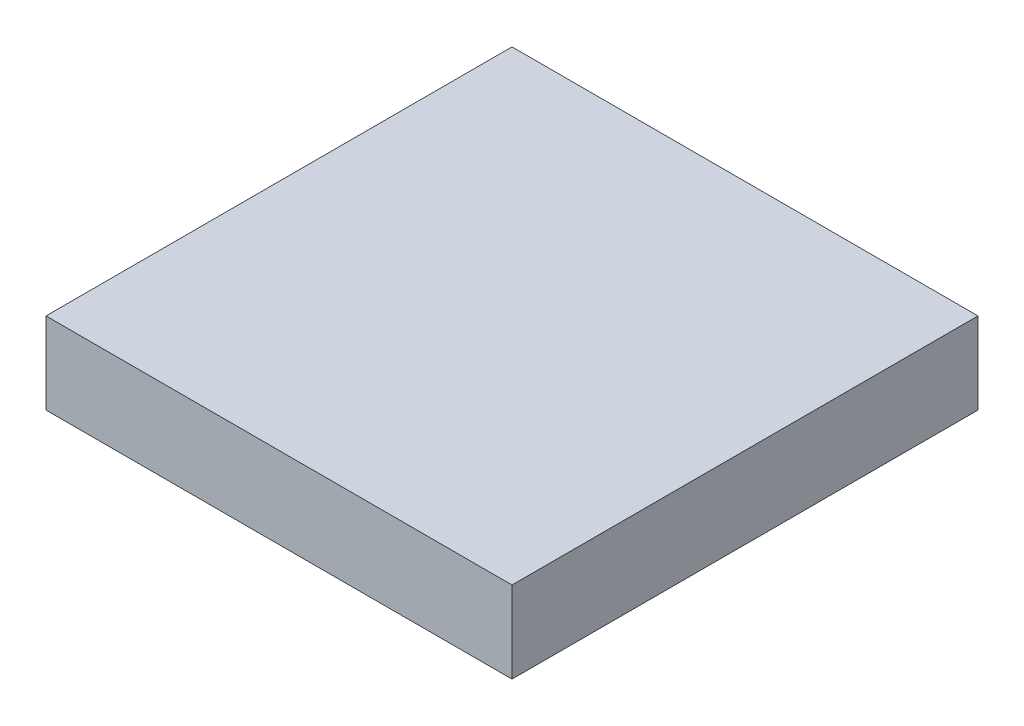
ISO-10303-21;
HEADER;
FILE_DESCRIPTION(('STEP AP214'),'2;1');
FILE_NAME('part.step','',(''),(''),'','','');
FILE_SCHEMA(('AUTOMOTIVE_DESIGN { 1 0 10303 214 1 1 1 1 }'));
ENDSEC;
DATA;
#1=APPLICATION_CONTEXT('core data for automotive mechanical design processes');
#2=APPLICATION_PROTOCOL_DEFINITION('international standard','automotive_design',2000,#1);
#3=PRODUCT_CONTEXT('',#1,'mechanical');
#4=PRODUCT('Part','Part','',(#3));
#5=PRODUCT_RELATED_PRODUCT_CATEGORY('part','',(#4));
#6=PRODUCT_DEFINITION_FORMATION('','',#4);
#7=PRODUCT_DEFINITION_CONTEXT('part definition',#1,'design');
#8=PRODUCT_DEFINITION('design','',#6,#7);
#9=PRODUCT_DEFINITION_SHAPE('','',#8);
#10=(LENGTH_UNIT() NAMED_UNIT(*) SI_UNIT(.MILLI.,.METRE.));
#11=(NAMED_UNIT(*) PLANE_ANGLE_UNIT() SI_UNIT($,.RADIAN.));
#12=(NAMED_UNIT(*) SI_UNIT($,.STERADIAN.) SOLID_ANGLE_UNIT());
#13=UNCERTAINTY_MEASURE_WITH_UNIT(LENGTH_MEASURE(1.E-05),#10,'distance_accuracy_value','');
#14=(GEOMETRIC_REPRESENTATION_CONTEXT(3) GLOBAL_UNCERTAINTY_ASSIGNED_CONTEXT((#13)) GLOBAL_UNIT_ASSIGNED_CONTEXT((#10,
#11,#12)) REPRESENTATION_CONTEXT('',''));
#15=CARTESIAN_POINT('',(0.,0.,0.));
#16=DIRECTION('',(0.,0.,1.));
#17=DIRECTION('',(1.,0.,0.));
#18=AXIS2_PLACEMENT_3D('',#15,#16,#17);
#19=CARTESIAN_POINT('',(28.575,10.,-28.575));
#20=DIRECTION('',(-1.,0.,0.));
#21=DIRECTION('',(0.,0.,1.));
#22=AXIS2_PLACEMENT_3D('',#19,#20,#21);
#23=PLANE('',#22);
#24=DIRECTION('',(0.,0.,-1.));
#25=VECTOR('',#24,1.);
#26=CARTESIAN_POINT('',(28.575,0.,-28.575));
#27=LINE('',#26,#25);
#28=CARTESIAN_POINT('',(28.575,0.,28.575));
#29=VERTEX_POINT('',#28);
#30=CARTESIAN_POINT('',(28.575,0.,-28.575));
#31=VERTEX_POINT('',#30);
#32=EDGE_CURVE('E112',#29,#31,#27,.T.);
#33=ORIENTED_EDGE('',*,*,#32,.T.);
#34=DIRECTION('',(0.,-1.,0.));
#35=VECTOR('',#34,1.);
#36=CARTESIAN_POINT('',(28.575,10.,-28.575));
#37=LINE('',#36,#35);
#38=CARTESIAN_POINT('',(28.575,10.,-28.575));
#39=VERTEX_POINT('',#38);
#40=EDGE_CURVE('E12',#39,#31,#37,.T.);
#41=ORIENTED_EDGE('',*,*,#40,.F.);
#42=DIRECTION('',(0.,0.,-1.));
#43=VECTOR('',#42,1.);
#44=CARTESIAN_POINT('',(28.575,10.,-28.575));
#45=LINE('',#44,#43);
#46=CARTESIAN_POINT('',(28.575,10.,28.575));
#47=VERTEX_POINT('',#46);
#48=EDGE_CURVE('E100',#47,#39,#45,.T.);
#49=ORIENTED_EDGE('',*,*,#48,.F.);
#50=DIRECTION('',(0.,-1.,0.));
#51=VECTOR('',#50,1.);
#52=CARTESIAN_POINT('',(28.575,10.,28.575));
#53=LINE('',#52,#51);
#54=EDGE_CURVE('E108',#47,#29,#53,.T.);
#55=ORIENTED_EDGE('',*,*,#54,.T.);
#56=EDGE_LOOP('',(#33,#41,#49,#55));
#57=FACE_BOUND('',#56,.T.);
#58=ADVANCED_FACE('F49',(#57),#23,.F.);
#59=CARTESIAN_POINT('',(-28.575,10.,-28.575));
#60=DIRECTION('',(0.,0.,1.));
#61=DIRECTION('',(1.,0.,0.));
#62=AXIS2_PLACEMENT_3D('',#59,#60,#61);
#63=PLANE('',#62);
#64=DIRECTION('',(-1.,0.,0.));
#65=VECTOR('',#64,1.);
#66=CARTESIAN_POINT('',(-28.575,0.,-28.575));
#67=LINE('',#66,#65);
#68=CARTESIAN_POINT('',(-28.575,0.,-28.575));
#69=VERTEX_POINT('',#68);
#70=EDGE_CURVE('E104',#31,#69,#67,.T.);
#71=ORIENTED_EDGE('',*,*,#70,.T.);
#72=DIRECTION('',(0.,-1.,0.));
#73=VECTOR('',#72,1.);
#74=CARTESIAN_POINT('',(-28.575,10.,-28.575));
#75=LINE('',#74,#73);
#76=CARTESIAN_POINT('',(-28.575,10.,-28.575));
#77=VERTEX_POINT('',#76);
#78=EDGE_CURVE('E57',#77,#69,#75,.T.);
#79=ORIENTED_EDGE('',*,*,#78,.F.);
#80=DIRECTION('',(-1.,0.,0.));
#81=VECTOR('',#80,1.);
#82=CARTESIAN_POINT('',(-28.575,10.,-28.575));
#83=LINE('',#82,#81);
#84=EDGE_CURVE('E95',#39,#77,#83,.T.);
#85=ORIENTED_EDGE('',*,*,#84,.F.);
#86=ORIENTED_EDGE('',*,*,#40,.T.);
#87=EDGE_LOOP('',(#71,#79,#85,#86));
#88=FACE_BOUND('',#87,.T.);
#89=ADVANCED_FACE('F103',(#88),#63,.F.);
#90=CARTESIAN_POINT('',(-28.575,10.,-28.575));
#91=DIRECTION('',(1.,0.,0.));
#92=DIRECTION('',(0.,0.,-1.));
#93=AXIS2_PLACEMENT_3D('',#90,#91,#92);
#94=PLANE('',#93);
#95=DIRECTION('',(0.,0.,1.));
#96=VECTOR('',#95,1.);
#97=CARTESIAN_POINT('',(-28.575,0.,-28.575));
#98=LINE('',#97,#96);
#99=CARTESIAN_POINT('',(-28.575,0.,28.575));
#100=VERTEX_POINT('',#99);
#101=EDGE_CURVE('E82',#69,#100,#98,.T.);
#102=ORIENTED_EDGE('',*,*,#101,.T.);
#103=DIRECTION('',(0.,-1.,0.));
#104=VECTOR('',#103,1.);
#105=CARTESIAN_POINT('',(-28.575,10.,28.575));
#106=LINE('',#105,#104);
#107=CARTESIAN_POINT('',(-28.575,10.,28.575));
#108=VERTEX_POINT('',#107);
#109=EDGE_CURVE('E105',#108,#100,#106,.T.);
#110=ORIENTED_EDGE('',*,*,#109,.F.);
#111=DIRECTION('',(0.,0.,1.));
#112=VECTOR('',#111,1.);
#113=CARTESIAN_POINT('',(-28.575,10.,-28.575));
#114=LINE('',#113,#112);
#115=EDGE_CURVE('E98',#77,#108,#114,.T.);
#116=ORIENTED_EDGE('',*,*,#115,.F.);
#117=ORIENTED_EDGE('',*,*,#78,.T.);
#118=EDGE_LOOP('',(#102,#110,#116,#117));
#119=FACE_BOUND('',#118,.T.);
#120=ADVANCED_FACE('F106',(#119),#94,.F.);
#121=CARTESIAN_POINT('',(-28.575,10.,28.575));
#122=DIRECTION('',(0.,0.,-1.));
#123=DIRECTION('',(-1.,0.,0.));
#124=AXIS2_PLACEMENT_3D('',#121,#122,#123);
#125=PLANE('',#124);
#126=DIRECTION('',(1.,0.,0.));
#127=VECTOR('',#126,1.);
#128=CARTESIAN_POINT('',(-28.575,0.,28.575));
#129=LINE('',#128,#127);
#130=EDGE_CURVE('E88',#100,#29,#129,.T.);
#131=ORIENTED_EDGE('',*,*,#130,.T.);
#132=ORIENTED_EDGE('',*,*,#54,.F.);
#133=DIRECTION('',(1.,0.,0.));
#134=VECTOR('',#133,1.);
#135=CARTESIAN_POINT('',(-28.575,10.,28.575));
#136=LINE('',#135,#134);
#137=EDGE_CURVE('E65',#108,#47,#136,.T.);
#138=ORIENTED_EDGE('',*,*,#137,.F.);
#139=ORIENTED_EDGE('',*,*,#109,.T.);
#140=EDGE_LOOP('',(#131,#132,#138,#139));
#141=FACE_BOUND('',#140,.T.);
#142=ADVANCED_FACE('F119',(#141),#125,.F.);
#143=CARTESIAN_POINT('',(0.,10.,0.));
#144=DIRECTION('',(0.,1.,0.));
#145=DIRECTION('',(0.,0.,1.));
#146=AXIS2_PLACEMENT_3D('',#143,#144,#145);
#147=PLANE('',#146);
#148=ORIENTED_EDGE('',*,*,#48,.T.);
#149=ORIENTED_EDGE('',*,*,#84,.T.);
#150=ORIENTED_EDGE('',*,*,#115,.T.);
#151=ORIENTED_EDGE('',*,*,#137,.T.);
#152=EDGE_LOOP('',(#148,#149,#150,#151));
#153=FACE_BOUND('',#152,.T.);
#154=ADVANCED_FACE('F96',(#153),#147,.T.);
#155=CARTESIAN_POINT('',(0.,0.,0.));
#156=DIRECTION('',(0.,1.,0.));
#157=DIRECTION('',(0.,0.,1.));
#158=AXIS2_PLACEMENT_3D('',#155,#156,#157);
#159=PLANE('',#158);
#160=ORIENTED_EDGE('',*,*,#32,.F.);
#161=ORIENTED_EDGE('',*,*,#130,.F.);
#162=ORIENTED_EDGE('',*,*,#101,.F.);
#163=ORIENTED_EDGE('',*,*,#70,.F.);
#164=EDGE_LOOP('',(#160,#161,#162,#163));
#165=FACE_BOUND('',#164,.T.);
#166=ADVANCED_FACE('F122',(#165),#159,.F.);
#167=CLOSED_SHELL('',(#58,#89,#120,#142,#154,#166));
#168=MANIFOLD_SOLID_BREP('B2',#167);
#169=CARTESIAN_POINT('',(28.575,10.,28.575));
#170=DIRECTION('',(-1.,0.,0.));
#171=DIRECTION('',(0.,0.,1.));
#172=AXIS2_PLACEMENT_3D('',#169,#170,#171);
#173=PLANE('',#172);
#174=DIRECTION('',(0.,0.,-1.));
#175=VECTOR('',#174,1.);
#176=CARTESIAN_POINT('',(28.575,0.,28.575));
#177=LINE('',#176,#175);
#178=CARTESIAN_POINT('',(28.575,0.,28.575));
#179=VERTEX_POINT('',#178);
#180=CARTESIAN_POINT('',(28.575,0.,-28.575));
#181=VERTEX_POINT('',#180);
#182=EDGE_CURVE('E259',#179,#181,#177,.T.);
#183=ORIENTED_EDGE('',*,*,#182,.T.);
#184=DIRECTION('',(0.,-1.,0.));
#185=VECTOR('',#184,1.);
#186=CARTESIAN_POINT('',(28.575,10.,-28.575));
#187=LINE('',#186,#185);
#188=CARTESIAN_POINT('',(28.575,10.,-28.575));
#189=VERTEX_POINT('',#188);
#190=EDGE_CURVE('E47',#189,#181,#187,.T.);
#191=ORIENTED_EDGE('',*,*,#190,.F.);
#192=DIRECTION('',(0.,0.,-1.));
#193=VECTOR('',#192,1.);
#194=CARTESIAN_POINT('',(28.575,10.,28.575));
#195=LINE('',#194,#193);
#196=CARTESIAN_POINT('',(28.575,10.,28.575));
#197=VERTEX_POINT('',#196);
#198=EDGE_CURVE('E247',#197,#189,#195,.T.);
#199=ORIENTED_EDGE('',*,*,#198,.F.);
#200=DIRECTION('',(0.,-1.,0.));
#201=VECTOR('',#200,1.);
#202=CARTESIAN_POINT('',(28.575,10.,28.575));
#203=LINE('',#202,#201);
#204=EDGE_CURVE('E255',#197,#179,#203,.T.);
#205=ORIENTED_EDGE('',*,*,#204,.T.);
#206=EDGE_LOOP('',(#183,#191,#199,#205));
#207=FACE_BOUND('',#206,.T.);
#208=ADVANCED_FACE('F196',(#207),#173,.F.);
#209=CARTESIAN_POINT('',(-28.575,10.,-28.575));
#210=DIRECTION('',(0.,0.,1.));
#211=DIRECTION('',(1.,0.,0.));
#212=AXIS2_PLACEMENT_3D('',#209,#210,#211);
#213=PLANE('',#212);
#214=DIRECTION('',(-1.,0.,0.));
#215=VECTOR('',#214,1.);
#216=CARTESIAN_POINT('',(-28.575,0.,-28.575));
#217=LINE('',#216,#215);
#218=CARTESIAN_POINT('',(-28.575,0.,-28.575));
#219=VERTEX_POINT('',#218);
#220=EDGE_CURVE('E251',#181,#219,#217,.T.);
#221=ORIENTED_EDGE('',*,*,#220,.T.);
#222=DIRECTION('',(0.,-1.,0.));
#223=VECTOR('',#222,1.);
#224=CARTESIAN_POINT('',(-28.575,10.,-28.575));
#225=LINE('',#224,#223);
#226=CARTESIAN_POINT('',(-28.575,10.,-28.575));
#227=VERTEX_POINT('',#226);
#228=EDGE_CURVE('E204',#227,#219,#225,.T.);
#229=ORIENTED_EDGE('',*,*,#228,.F.);
#230=DIRECTION('',(-1.,0.,0.));
#231=VECTOR('',#230,1.);
#232=CARTESIAN_POINT('',(-28.575,10.,-28.575));
#233=LINE('',#232,#231);
#234=EDGE_CURVE('E242',#189,#227,#233,.T.);
#235=ORIENTED_EDGE('',*,*,#234,.F.);
#236=ORIENTED_EDGE('',*,*,#190,.T.);
#237=EDGE_LOOP('',(#221,#229,#235,#236));
#238=FACE_BOUND('',#237,.T.);
#239=ADVANCED_FACE('F250',(#238),#213,.F.);
#240=CARTESIAN_POINT('',(-28.575,10.,28.575));
#241=DIRECTION('',(1.,0.,0.));
#242=DIRECTION('',(0.,0.,-1.));
#243=AXIS2_PLACEMENT_3D('',#240,#241,#242);
#244=PLANE('',#243);
#245=DIRECTION('',(0.,0.,1.));
#246=VECTOR('',#245,1.);
#247=CARTESIAN_POINT('',(-28.575,0.,28.575));
#248=LINE('',#247,#246);
#249=CARTESIAN_POINT('',(-28.575,0.,28.575));
#250=VERTEX_POINT('',#249);
#251=EDGE_CURVE('E229',#219,#250,#248,.T.);
#252=ORIENTED_EDGE('',*,*,#251,.T.);
#253=DIRECTION('',(0.,-1.,0.));
#254=VECTOR('',#253,1.);
#255=CARTESIAN_POINT('',(-28.575,10.,28.575));
#256=LINE('',#255,#254);
#257=CARTESIAN_POINT('',(-28.575,10.,28.575));
#258=VERTEX_POINT('',#257);
#259=EDGE_CURVE('E252',#258,#250,#256,.T.);
#260=ORIENTED_EDGE('',*,*,#259,.F.);
#261=DIRECTION('',(0.,0.,1.));
#262=VECTOR('',#261,1.);
#263=CARTESIAN_POINT('',(-28.575,10.,28.575));
#264=LINE('',#263,#262);
#265=EDGE_CURVE('E245',#227,#258,#264,.T.);
#266=ORIENTED_EDGE('',*,*,#265,.F.);
#267=ORIENTED_EDGE('',*,*,#228,.T.);
#268=EDGE_LOOP('',(#252,#260,#266,#267));
#269=FACE_BOUND('',#268,.T.);
#270=ADVANCED_FACE('F253',(#269),#244,.F.);
#271=CARTESIAN_POINT('',(-28.575,10.,28.575));
#272=DIRECTION('',(0.,0.,-1.));
#273=DIRECTION('',(-1.,0.,0.));
#274=AXIS2_PLACEMENT_3D('',#271,#272,#273);
#275=PLANE('',#274);
#276=DIRECTION('',(1.,0.,0.));
#277=VECTOR('',#276,1.);
#278=CARTESIAN_POINT('',(-28.575,0.,28.575));
#279=LINE('',#278,#277);
#280=EDGE_CURVE('E235',#250,#179,#279,.T.);
#281=ORIENTED_EDGE('',*,*,#280,.T.);
#282=ORIENTED_EDGE('',*,*,#204,.F.);
#283=DIRECTION('',(1.,0.,0.));
#284=VECTOR('',#283,1.);
#285=CARTESIAN_POINT('',(-28.575,10.,28.575));
#286=LINE('',#285,#284);
#287=EDGE_CURVE('E212',#258,#197,#286,.T.);
#288=ORIENTED_EDGE('',*,*,#287,.F.);
#289=ORIENTED_EDGE('',*,*,#259,.T.);
#290=EDGE_LOOP('',(#281,#282,#288,#289));
#291=FACE_BOUND('',#290,.T.);
#292=ADVANCED_FACE('F266',(#291),#275,.F.);
#293=CARTESIAN_POINT('',(0.,10.,0.));
#294=DIRECTION('',(0.,-1.,0.));
#295=DIRECTION('',(0.,0.,-1.));
#296=AXIS2_PLACEMENT_3D('',#293,#294,#295);
#297=PLANE('',#296);
#298=ORIENTED_EDGE('',*,*,#198,.T.);
#299=ORIENTED_EDGE('',*,*,#234,.T.);
#300=ORIENTED_EDGE('',*,*,#265,.T.);
#301=ORIENTED_EDGE('',*,*,#287,.T.);
#302=EDGE_LOOP('',(#298,#299,#300,#301));
#303=FACE_BOUND('',#302,.T.);
#304=ADVANCED_FACE('F243',(#303),#297,.F.);
#305=CARTESIAN_POINT('',(0.,0.,0.));
#306=DIRECTION('',(0.,-1.,0.));
#307=DIRECTION('',(0.,0.,-1.));
#308=AXIS2_PLACEMENT_3D('',#305,#306,#307);
#309=PLANE('',#308);
#310=ORIENTED_EDGE('',*,*,#182,.F.);
#311=ORIENTED_EDGE('',*,*,#280,.F.);
#312=ORIENTED_EDGE('',*,*,#251,.F.);
#313=ORIENTED_EDGE('',*,*,#220,.F.);
#314=EDGE_LOOP('',(#310,#311,#312,#313));
#315=FACE_BOUND('',#314,.T.);
#316=ADVANCED_FACE('F269',(#315),#309,.T.);
#317=CLOSED_SHELL('',(#208,#239,#270,#292,#304,#316));
#318=MANIFOLD_SOLID_BREP('B6_NOT_SHOWN',#317);
#319=ADVANCED_BREP_SHAPE_REPRESENTATION('',(#18,#168,#318),#14);
#320=SHAPE_DEFINITION_REPRESENTATION(#9,#319);
ENDSEC;
END-ISO-10303-21;
